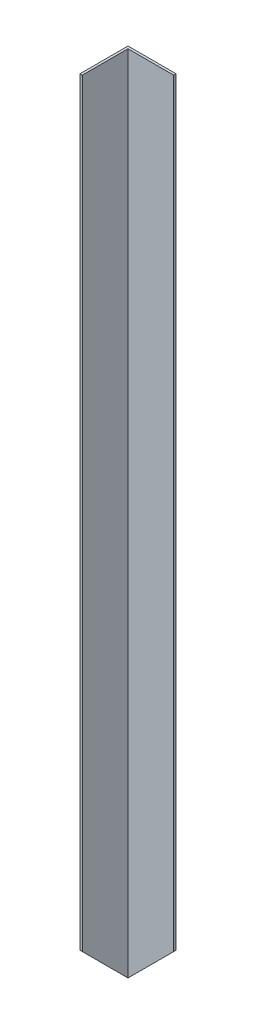
ISO-10303-21;
HEADER;
FILE_DESCRIPTION(('STEP AP214'),'2;1');
FILE_NAME('part.step','',(''),(''),'','','');
FILE_SCHEMA(('AUTOMOTIVE_DESIGN { 1 0 10303 214 1 1 1 1 }'));
ENDSEC;
DATA;
#1=APPLICATION_CONTEXT('core data for automotive mechanical design processes');
#2=APPLICATION_PROTOCOL_DEFINITION('international standard','automotive_design',2000,#1);
#3=PRODUCT_CONTEXT('',#1,'mechanical');
#4=PRODUCT('Part','Part','',(#3));
#5=PRODUCT_RELATED_PRODUCT_CATEGORY('part','',(#4));
#6=PRODUCT_DEFINITION_FORMATION('','',#4);
#7=PRODUCT_DEFINITION_CONTEXT('part definition',#1,'design');
#8=PRODUCT_DEFINITION('design','',#6,#7);
#9=PRODUCT_DEFINITION_SHAPE('','',#8);
#10=(LENGTH_UNIT() NAMED_UNIT(*) SI_UNIT(.MILLI.,.METRE.));
#11=(NAMED_UNIT(*) PLANE_ANGLE_UNIT() SI_UNIT($,.RADIAN.));
#12=(NAMED_UNIT(*) SI_UNIT($,.STERADIAN.) SOLID_ANGLE_UNIT());
#13=UNCERTAINTY_MEASURE_WITH_UNIT(LENGTH_MEASURE(1.E-05),#10,'distance_accuracy_value','');
#14=(GEOMETRIC_REPRESENTATION_CONTEXT(3) GLOBAL_UNCERTAINTY_ASSIGNED_CONTEXT((#13)) GLOBAL_UNIT_ASSIGNED_CONTEXT((#10,
#11,#12)) REPRESENTATION_CONTEXT('',''));
#15=CARTESIAN_POINT('',(0.,0.,0.));
#16=DIRECTION('',(0.,0.,1.));
#17=DIRECTION('',(1.,0.,0.));
#18=AXIS2_PLACEMENT_3D('',#15,#16,#17);
#19=CARTESIAN_POINT('',(-20.,672.,-20.1136363636364));
#20=DIRECTION('',(1.,0.,0.));
#21=DIRECTION('',(0.,0.,-1.));
#22=AXIS2_PLACEMENT_3D('',#19,#20,#21);
#23=PLANE('',#22);
#24=DIRECTION('',(0.,-1.,0.));
#25=VECTOR('',#24,1.);
#26=CARTESIAN_POINT('',(-20.,672.,-20.1136363636364));
#27=LINE('',#26,#25);
#28=CARTESIAN_POINT('',(-20.,672.,-20.1136363636364));
#29=VERTEX_POINT('',#28);
#30=CARTESIAN_POINT('',(-20.,0.,-20.1136363636364));
#31=VERTEX_POINT('',#30);
#32=EDGE_CURVE('E98',#29,#31,#27,.T.);
#33=ORIENTED_EDGE('',*,*,#32,.T.);
#34=DIRECTION('',(0.,-0.707106781186544,-0.707106781186551));
#35=VECTOR('',#34,1.);
#36=CARTESIAN_POINT('',(-20.,0.,-20.1136363636364));
#37=LINE('',#36,#35);
#38=CARTESIAN_POINT('',(-20.,39.9999999999996,19.8863636363636));
#39=VERTEX_POINT('',#38);
#40=EDGE_CURVE('E86',#39,#31,#37,.T.);
#41=ORIENTED_EDGE('',*,*,#40,.F.);
#42=DIRECTION('',(0.,-1.,0.));
#43=VECTOR('',#42,1.);
#44=CARTESIAN_POINT('',(-20.,672.,19.8863636363636));
#45=LINE('',#44,#43);
#46=CARTESIAN_POINT('',(-20.,672.,19.8863636363636));
#47=VERTEX_POINT('',#46);
#48=EDGE_CURVE('E39',#47,#39,#45,.T.);
#49=ORIENTED_EDGE('',*,*,#48,.F.);
#50=DIRECTION('',(0.,0.,1.));
#51=VECTOR('',#50,1.);
#52=CARTESIAN_POINT('',(-20.,672.,-20.1136363636364));
#53=LINE('',#52,#51);
#54=EDGE_CURVE('E122',#29,#47,#53,.T.);
#55=ORIENTED_EDGE('',*,*,#54,.F.);
#56=EDGE_LOOP('',(#33,#41,#49,#55));
#57=FACE_BOUND('',#56,.T.);
#58=ADVANCED_FACE('F32',(#57),#23,.F.);
#59=CARTESIAN_POINT('',(-20.,672.,19.8863636363636));
#60=DIRECTION('',(0.,0.,-1.));
#61=DIRECTION('',(-1.,0.,0.));
#62=AXIS2_PLACEMENT_3D('',#59,#60,#61);
#63=PLANE('',#62);
#64=ORIENTED_EDGE('',*,*,#48,.T.);
#65=DIRECTION('',(-1.,0.,0.));
#66=VECTOR('',#65,1.);
#67=CARTESIAN_POINT('',(570.,39.9999999999996,19.8863636363635));
#68=LINE('',#67,#66);
#69=CARTESIAN_POINT('',(-18.,39.9999999999996,19.8863636363636));
#70=VERTEX_POINT('',#69);
#71=EDGE_CURVE('E83',#70,#39,#68,.T.);
#72=ORIENTED_EDGE('',*,*,#71,.F.);
#73=DIRECTION('',(0.,-1.,0.));
#74=VECTOR('',#73,1.);
#75=CARTESIAN_POINT('',(-18.,672.,19.8863636363636));
#76=LINE('',#75,#74);
#77=CARTESIAN_POINT('',(-18.,672.,19.8863636363636));
#78=VERTEX_POINT('',#77);
#79=EDGE_CURVE('E102',#78,#70,#76,.T.);
#80=ORIENTED_EDGE('',*,*,#79,.F.);
#81=DIRECTION('',(1.,0.,0.));
#82=VECTOR('',#81,1.);
#83=CARTESIAN_POINT('',(-20.,672.,19.8863636363636));
#84=LINE('',#83,#82);
#85=EDGE_CURVE('E101',#47,#78,#84,.T.);
#86=ORIENTED_EDGE('',*,*,#85,.F.);
#87=EDGE_LOOP('',(#64,#72,#80,#86));
#88=FACE_BOUND('',#87,.T.);
#89=ADVANCED_FACE('F100',(#88),#63,.F.);
#90=CARTESIAN_POINT('',(-18.,672.,-18.1136363636364));
#91=DIRECTION('',(-1.,0.,0.));
#92=DIRECTION('',(0.,0.,1.));
#93=AXIS2_PLACEMENT_3D('',#90,#91,#92);
#94=PLANE('',#93);
#95=ORIENTED_EDGE('',*,*,#79,.T.);
#96=DIRECTION('',(0.,-0.707106781186544,-0.707106781186551));
#97=VECTOR('',#96,1.);
#98=CARTESIAN_POINT('',(-18.,336.999999999997,316.886363636364));
#99=LINE('',#98,#97);
#100=CARTESIAN_POINT('',(-18.,2.,-18.1136363636364));
#101=VERTEX_POINT('',#100);
#102=EDGE_CURVE('E88',#70,#101,#99,.T.);
#103=ORIENTED_EDGE('',*,*,#102,.T.);
#104=DIRECTION('',(0.,-1.,0.));
#105=VECTOR('',#104,1.);
#106=CARTESIAN_POINT('',(-18.,672.,-18.1136363636364));
#107=LINE('',#106,#105);
#108=CARTESIAN_POINT('',(-18.,672.,-18.1136363636364));
#109=VERTEX_POINT('',#108);
#110=EDGE_CURVE('E103',#109,#101,#107,.T.);
#111=ORIENTED_EDGE('',*,*,#110,.F.);
#112=DIRECTION('',(0.,0.,-1.));
#113=VECTOR('',#112,1.);
#114=CARTESIAN_POINT('',(-18.,672.,-18.1136363636364));
#115=LINE('',#114,#113);
#116=EDGE_CURVE('E119',#78,#109,#115,.T.);
#117=ORIENTED_EDGE('',*,*,#116,.F.);
#118=EDGE_LOOP('',(#95,#103,#111,#117));
#119=FACE_BOUND('',#118,.T.);
#120=ADVANCED_FACE('F135',(#119),#94,.F.);
#121=CARTESIAN_POINT('',(-18.,672.,-18.1136363636364));
#122=DIRECTION('',(0.,0.,-1.));
#123=DIRECTION('',(-1.,0.,0.));
#124=AXIS2_PLACEMENT_3D('',#121,#122,#123);
#125=PLANE('',#124);
#126=ORIENTED_EDGE('',*,*,#110,.T.);
#127=DIRECTION('',(0.707106781186547,0.707106781186549,0.));
#128=VECTOR('',#127,1.);
#129=CARTESIAN_POINT('',(317.,337.000000000001,-18.1136363636364));
#130=LINE('',#129,#128);
#131=CARTESIAN_POINT('',(20.,40.0000000000001,-18.1136363636364));
#132=VERTEX_POINT('',#131);
#133=EDGE_CURVE('E124',#101,#132,#130,.T.);
#134=ORIENTED_EDGE('',*,*,#133,.T.);
#135=DIRECTION('',(0.,-1.,0.));
#136=VECTOR('',#135,1.);
#137=CARTESIAN_POINT('',(20.,672.,-18.1136363636364));
#138=LINE('',#137,#136);
#139=CARTESIAN_POINT('',(20.,672.,-18.1136363636364));
#140=VERTEX_POINT('',#139);
#141=EDGE_CURVE('E108',#140,#132,#138,.T.);
#142=ORIENTED_EDGE('',*,*,#141,.F.);
#143=DIRECTION('',(1.,0.,0.));
#144=VECTOR('',#143,1.);
#145=CARTESIAN_POINT('',(-18.,672.,-18.1136363636364));
#146=LINE('',#145,#144);
#147=EDGE_CURVE('E117',#109,#140,#146,.T.);
#148=ORIENTED_EDGE('',*,*,#147,.F.);
#149=EDGE_LOOP('',(#126,#134,#142,#148));
#150=FACE_BOUND('',#149,.T.);
#151=ADVANCED_FACE('F143',(#150),#125,.F.);
#152=CARTESIAN_POINT('',(20.,672.,-20.1136363636364));
#153=DIRECTION('',(-1.,0.,0.));
#154=DIRECTION('',(0.,0.,1.));
#155=AXIS2_PLACEMENT_3D('',#152,#153,#154);
#156=PLANE('',#155);
#157=ORIENTED_EDGE('',*,*,#141,.T.);
#158=DIRECTION('',(0.,0.,-1.));
#159=VECTOR('',#158,1.);
#160=CARTESIAN_POINT('',(20.,40.0000000000001,569.886363636364));
#161=LINE('',#160,#159);
#162=CARTESIAN_POINT('',(20.,40.0000000000001,-20.1136363636364));
#163=VERTEX_POINT('',#162);
#164=EDGE_CURVE('E127',#132,#163,#161,.T.);
#165=ORIENTED_EDGE('',*,*,#164,.T.);
#166=DIRECTION('',(0.,-1.,0.));
#167=VECTOR('',#166,1.);
#168=CARTESIAN_POINT('',(20.,672.,-20.1136363636364));
#169=LINE('',#168,#167);
#170=CARTESIAN_POINT('',(20.,672.,-20.1136363636364));
#171=VERTEX_POINT('',#170);
#172=EDGE_CURVE('E111',#171,#163,#169,.T.);
#173=ORIENTED_EDGE('',*,*,#172,.F.);
#174=DIRECTION('',(0.,0.,-1.));
#175=VECTOR('',#174,1.);
#176=CARTESIAN_POINT('',(20.,672.,-20.1136363636364));
#177=LINE('',#176,#175);
#178=EDGE_CURVE('E51',#140,#171,#177,.T.);
#179=ORIENTED_EDGE('',*,*,#178,.F.);
#180=EDGE_LOOP('',(#157,#165,#173,#179));
#181=FACE_BOUND('',#180,.T.);
#182=ADVANCED_FACE('F153',(#181),#156,.F.);
#183=CARTESIAN_POINT('',(-20.,672.,-20.1136363636364));
#184=DIRECTION('',(0.,0.,1.));
#185=DIRECTION('',(1.,0.,0.));
#186=AXIS2_PLACEMENT_3D('',#183,#184,#185);
#187=PLANE('',#186);
#188=ORIENTED_EDGE('',*,*,#172,.T.);
#189=DIRECTION('',(0.707106781186546,0.707106781186548,0.));
#190=VECTOR('',#189,1.);
#191=CARTESIAN_POINT('',(-20.,0.,-20.1136363636364));
#192=LINE('',#191,#190);
#193=EDGE_CURVE('E130',#31,#163,#192,.T.);
#194=ORIENTED_EDGE('',*,*,#193,.F.);
#195=ORIENTED_EDGE('',*,*,#32,.F.);
#196=DIRECTION('',(-1.,0.,0.));
#197=VECTOR('',#196,1.);
#198=CARTESIAN_POINT('',(-20.,672.,-20.1136363636364));
#199=LINE('',#198,#197);
#200=EDGE_CURVE('E46',#171,#29,#199,.T.);
#201=ORIENTED_EDGE('',*,*,#200,.F.);
#202=EDGE_LOOP('',(#188,#194,#195,#201));
#203=FACE_BOUND('',#202,.T.);
#204=ADVANCED_FACE('F146',(#203),#187,.F.);
#205=CARTESIAN_POINT('',(0.,672.,0.));
#206=DIRECTION('',(0.,1.,0.));
#207=DIRECTION('',(0.,0.,1.));
#208=AXIS2_PLACEMENT_3D('',#205,#206,#207);
#209=PLANE('',#208);
#210=ORIENTED_EDGE('',*,*,#54,.T.);
#211=ORIENTED_EDGE('',*,*,#85,.T.);
#212=ORIENTED_EDGE('',*,*,#116,.T.);
#213=ORIENTED_EDGE('',*,*,#147,.T.);
#214=ORIENTED_EDGE('',*,*,#178,.T.);
#215=ORIENTED_EDGE('',*,*,#200,.T.);
#216=EDGE_LOOP('',(#210,#211,#212,#213,#214,#215));
#217=FACE_BOUND('',#216,.T.);
#218=ADVANCED_FACE('F144',(#217),#209,.T.);
#219=CARTESIAN_POINT('',(-20.,0.,569.886363636364));
#220=DIRECTION('',(-0.707106781186549,0.707106781186547,0.));
#221=DIRECTION('',(-0.707106781186547,-0.707106781186549,0.));
#222=AXIS2_PLACEMENT_3D('',#219,#220,#221);
#223=PLANE('',#222);
#224=ORIENTED_EDGE('',*,*,#133,.F.);
#225=DIRECTION('',(-0.577350269189623,-0.577350269189624,-0.57735026918963));
#226=VECTOR('',#225,1.);
#227=CARTESIAN_POINT('',(176.666666666667,196.666666666668,176.553030303033));
#228=LINE('',#227,#226);
#229=EDGE_CURVE('E11',#101,#31,#228,.T.);
#230=ORIENTED_EDGE('',*,*,#229,.T.);
#231=ORIENTED_EDGE('',*,*,#193,.T.);
#232=ORIENTED_EDGE('',*,*,#164,.F.);
#233=EDGE_LOOP('',(#224,#230,#231,#232));
#234=FACE_BOUND('',#233,.T.);
#235=ADVANCED_FACE('F139',(#234),#223,.F.);
#236=CARTESIAN_POINT('',(570.,0.,-20.1136363636365));
#237=DIRECTION('',(0.,0.707106781186551,-0.707106781186544));
#238=DIRECTION('',(0.,0.707106781186544,0.707106781186551));
#239=AXIS2_PLACEMENT_3D('',#236,#237,#238);
#240=PLANE('',#239);
#241=ORIENTED_EDGE('',*,*,#71,.T.);
#242=ORIENTED_EDGE('',*,*,#40,.T.);
#243=ORIENTED_EDGE('',*,*,#229,.F.);
#244=ORIENTED_EDGE('',*,*,#102,.F.);
#245=EDGE_LOOP('',(#241,#242,#243,#244));
#246=FACE_BOUND('',#245,.T.);
#247=ADVANCED_FACE('F85',(#246),#240,.F.);
#248=CLOSED_SHELL('',(#58,#89,#120,#151,#182,#204,#218,#235,#247));
#249=MANIFOLD_SOLID_BREP('B2',#248);
#250=ADVANCED_BREP_SHAPE_REPRESENTATION('',(#18,#249),#14);
#251=SHAPE_DEFINITION_REPRESENTATION(#9,#250);
ENDSEC;
END-ISO-10303-21;
